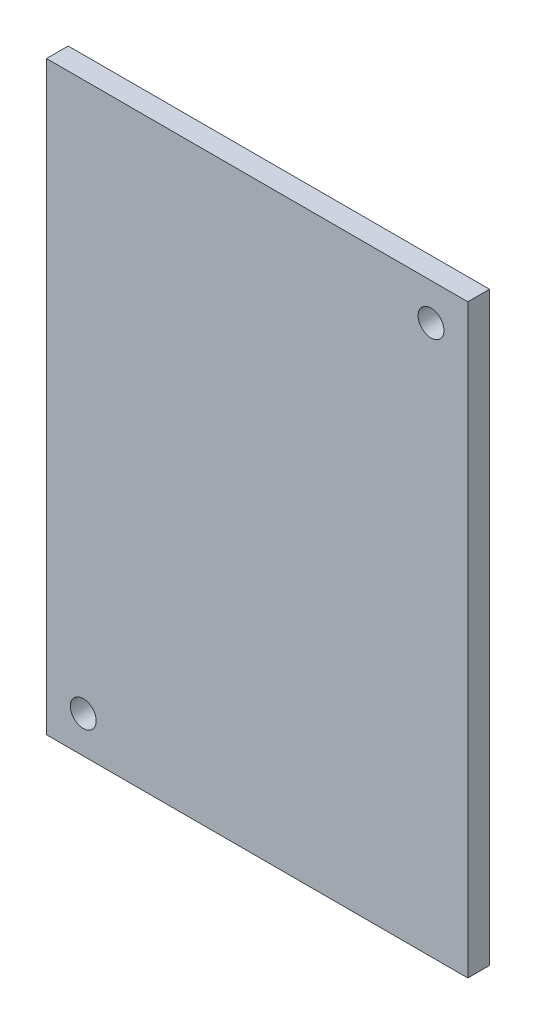
ISO-10303-21;
HEADER;
FILE_DESCRIPTION(('STEP AP214'),'2;1');
FILE_NAME('part.step','',(''),(''),'','','');
FILE_SCHEMA(('AUTOMOTIVE_DESIGN { 1 0 10303 214 1 1 1 1 }'));
ENDSEC;
DATA;
#1=APPLICATION_CONTEXT('core data for automotive mechanical design processes');
#2=APPLICATION_PROTOCOL_DEFINITION('international standard','automotive_design',2000,#1);
#3=PRODUCT_CONTEXT('',#1,'mechanical');
#4=PRODUCT('Part','Part','',(#3));
#5=PRODUCT_RELATED_PRODUCT_CATEGORY('part','',(#4));
#6=PRODUCT_DEFINITION_FORMATION('','',#4);
#7=PRODUCT_DEFINITION_CONTEXT('part definition',#1,'design');
#8=PRODUCT_DEFINITION('design','',#6,#7);
#9=PRODUCT_DEFINITION_SHAPE('','',#8);
#10=(LENGTH_UNIT() NAMED_UNIT(*) SI_UNIT(.MILLI.,.METRE.));
#11=(NAMED_UNIT(*) PLANE_ANGLE_UNIT() SI_UNIT($,.RADIAN.));
#12=(NAMED_UNIT(*) SI_UNIT($,.STERADIAN.) SOLID_ANGLE_UNIT());
#13=UNCERTAINTY_MEASURE_WITH_UNIT(LENGTH_MEASURE(1.E-05),#10,'distance_accuracy_value','');
#14=(GEOMETRIC_REPRESENTATION_CONTEXT(3) GLOBAL_UNCERTAINTY_ASSIGNED_CONTEXT((#13)) GLOBAL_UNIT_ASSIGNED_CONTEXT((#10,
#11,#12)) REPRESENTATION_CONTEXT('',''));
#15=CARTESIAN_POINT('',(0.,0.,0.));
#16=DIRECTION('',(0.,0.,1.));
#17=DIRECTION('',(1.,0.,0.));
#18=AXIS2_PLACEMENT_3D('',#15,#16,#17);
#19=CARTESIAN_POINT('',(29.085,40.43,2.9972));
#20=DIRECTION('',(0.,-1.,0.));
#21=DIRECTION('',(0.,0.,-1.));
#22=AXIS2_PLACEMENT_3D('',#19,#20,#21);
#23=PLANE('',#22);
#24=DIRECTION('',(-1.,0.,0.));
#25=VECTOR('',#24,1.);
#26=CARTESIAN_POINT('',(29.085,40.43,0.));
#27=LINE('',#26,#25);
#28=CARTESIAN_POINT('',(29.085,40.43,0.));
#29=VERTEX_POINT('',#28);
#30=CARTESIAN_POINT('',(-29.085,40.43,0.));
#31=VERTEX_POINT('',#30);
#32=EDGE_CURVE('E104',#29,#31,#27,.T.);
#33=ORIENTED_EDGE('',*,*,#32,.T.);
#34=DIRECTION('',(0.,0.,-1.));
#35=VECTOR('',#34,1.);
#36=CARTESIAN_POINT('',(-29.085,40.43,2.9972));
#37=LINE('',#36,#35);
#38=CARTESIAN_POINT('',(-29.085,40.43,2.9972));
#39=VERTEX_POINT('',#38);
#40=EDGE_CURVE('E11',#39,#31,#37,.T.);
#41=ORIENTED_EDGE('',*,*,#40,.F.);
#42=DIRECTION('',(-1.,0.,0.));
#43=VECTOR('',#42,1.);
#44=CARTESIAN_POINT('',(29.085,40.43,2.9972));
#45=LINE('',#44,#43);
#46=CARTESIAN_POINT('',(29.085,40.43,2.9972));
#47=VERTEX_POINT('',#46);
#48=EDGE_CURVE('E92',#47,#39,#45,.T.);
#49=ORIENTED_EDGE('',*,*,#48,.F.);
#50=DIRECTION('',(0.,0.,-1.));
#51=VECTOR('',#50,1.);
#52=CARTESIAN_POINT('',(29.085,40.43,2.9972));
#53=LINE('',#52,#51);
#54=EDGE_CURVE('E100',#47,#29,#53,.T.);
#55=ORIENTED_EDGE('',*,*,#54,.T.);
#56=EDGE_LOOP('',(#33,#41,#49,#55));
#57=FACE_BOUND('',#56,.T.);
#58=ADVANCED_FACE('F41',(#57),#23,.F.);
#59=CARTESIAN_POINT('',(-29.085,-40.43,2.9972));
#60=DIRECTION('',(1.,0.,0.));
#61=DIRECTION('',(0.,0.,-1.));
#62=AXIS2_PLACEMENT_3D('',#59,#60,#61);
#63=PLANE('',#62);
#64=DIRECTION('',(0.,-1.,0.));
#65=VECTOR('',#64,1.);
#66=CARTESIAN_POINT('',(-29.085,-40.43,0.));
#67=LINE('',#66,#65);
#68=CARTESIAN_POINT('',(-29.085,-40.43,0.));
#69=VERTEX_POINT('',#68);
#70=EDGE_CURVE('E96',#31,#69,#67,.T.);
#71=ORIENTED_EDGE('',*,*,#70,.T.);
#72=DIRECTION('',(0.,0.,-1.));
#73=VECTOR('',#72,1.);
#74=CARTESIAN_POINT('',(-29.085,-40.43,2.9972));
#75=LINE('',#74,#73);
#76=CARTESIAN_POINT('',(-29.085,-40.43,2.9972));
#77=VERTEX_POINT('',#76);
#78=EDGE_CURVE('E49',#77,#69,#75,.T.);
#79=ORIENTED_EDGE('',*,*,#78,.F.);
#80=DIRECTION('',(0.,-1.,0.));
#81=VECTOR('',#80,1.);
#82=CARTESIAN_POINT('',(-29.085,-40.43,2.9972));
#83=LINE('',#82,#81);
#84=EDGE_CURVE('E87',#39,#77,#83,.T.);
#85=ORIENTED_EDGE('',*,*,#84,.F.);
#86=ORIENTED_EDGE('',*,*,#40,.T.);
#87=EDGE_LOOP('',(#71,#79,#85,#86));
#88=FACE_BOUND('',#87,.T.);
#89=ADVANCED_FACE('F95',(#88),#63,.F.);
#90=CARTESIAN_POINT('',(29.085,-40.43,2.9972));
#91=DIRECTION('',(0.,1.,0.));
#92=DIRECTION('',(0.,0.,1.));
#93=AXIS2_PLACEMENT_3D('',#90,#91,#92);
#94=PLANE('',#93);
#95=DIRECTION('',(1.,0.,0.));
#96=VECTOR('',#95,1.);
#97=CARTESIAN_POINT('',(29.085,-40.43,0.));
#98=LINE('',#97,#96);
#99=CARTESIAN_POINT('',(29.085,-40.43,0.));
#100=VERTEX_POINT('',#99);
#101=EDGE_CURVE('E74',#69,#100,#98,.T.);
#102=ORIENTED_EDGE('',*,*,#101,.T.);
#103=DIRECTION('',(0.,0.,-1.));
#104=VECTOR('',#103,1.);
#105=CARTESIAN_POINT('',(29.085,-40.43,2.9972));
#106=LINE('',#105,#104);
#107=CARTESIAN_POINT('',(29.085,-40.43,2.9972));
#108=VERTEX_POINT('',#107);
#109=EDGE_CURVE('E97',#108,#100,#106,.T.);
#110=ORIENTED_EDGE('',*,*,#109,.F.);
#111=DIRECTION('',(1.,0.,0.));
#112=VECTOR('',#111,1.);
#113=CARTESIAN_POINT('',(29.085,-40.43,2.9972));
#114=LINE('',#113,#112);
#115=EDGE_CURVE('E90',#77,#108,#114,.T.);
#116=ORIENTED_EDGE('',*,*,#115,.F.);
#117=ORIENTED_EDGE('',*,*,#78,.T.);
#118=EDGE_LOOP('',(#102,#110,#116,#117));
#119=FACE_BOUND('',#118,.T.);
#120=ADVANCED_FACE('F98',(#119),#94,.F.);
#121=CARTESIAN_POINT('',(29.085,-40.43,2.9972));
#122=DIRECTION('',(-1.,0.,0.));
#123=DIRECTION('',(0.,0.,1.));
#124=AXIS2_PLACEMENT_3D('',#121,#122,#123);
#125=PLANE('',#124);
#126=DIRECTION('',(0.,1.,0.));
#127=VECTOR('',#126,1.);
#128=CARTESIAN_POINT('',(29.085,-40.43,0.));
#129=LINE('',#128,#127);
#130=EDGE_CURVE('E80',#100,#29,#129,.T.);
#131=ORIENTED_EDGE('',*,*,#130,.T.);
#132=ORIENTED_EDGE('',*,*,#54,.F.);
#133=DIRECTION('',(0.,1.,0.));
#134=VECTOR('',#133,1.);
#135=CARTESIAN_POINT('',(29.085,-40.43,2.9972));
#136=LINE('',#135,#134);
#137=EDGE_CURVE('E57',#108,#47,#136,.T.);
#138=ORIENTED_EDGE('',*,*,#137,.F.);
#139=ORIENTED_EDGE('',*,*,#109,.T.);
#140=EDGE_LOOP('',(#131,#132,#138,#139));
#141=FACE_BOUND('',#140,.T.);
#142=ADVANCED_FACE('F112',(#141),#125,.F.);
#143=CARTESIAN_POINT('',(0.,0.,2.9972));
#144=DIRECTION('',(0.,0.,-1.));
#145=DIRECTION('',(-1.,0.,0.));
#146=AXIS2_PLACEMENT_3D('',#143,#144,#145);
#147=PLANE('',#146);
#148=CARTESIAN_POINT('',(24.005,35.35,2.9972));
#149=DIRECTION('',(0.,0.,1.));
#150=DIRECTION('',(1.,0.,0.));
#151=AXIS2_PLACEMENT_3D('',#148,#149,#150);
#152=CIRCLE('',#151,1.786001);
#153=CARTESIAN_POINT('',(25.791001,35.35,2.9972));
#154=VERTEX_POINT('',#153);
#155=EDGE_CURVE('E126',#154,#154,#152,.T.);
#156=ORIENTED_EDGE('',*,*,#155,.F.);
#157=EDGE_LOOP('',(#156));
#158=FACE_BOUND('',#157,.T.);
#159=CARTESIAN_POINT('',(-24.005,-35.35,2.9972));
#160=DIRECTION('',(0.,0.,1.));
#161=DIRECTION('',(1.,0.,0.));
#162=AXIS2_PLACEMENT_3D('',#159,#160,#161);
#163=CIRCLE('',#162,1.786001);
#164=CARTESIAN_POINT('',(-22.218999,-35.35,2.9972));
#165=VERTEX_POINT('',#164);
#166=EDGE_CURVE('E120',#165,#165,#163,.T.);
#167=ORIENTED_EDGE('',*,*,#166,.F.);
#168=EDGE_LOOP('',(#167));
#169=FACE_BOUND('',#168,.T.);
#170=ORIENTED_EDGE('',*,*,#48,.T.);
#171=ORIENTED_EDGE('',*,*,#84,.T.);
#172=ORIENTED_EDGE('',*,*,#115,.T.);
#173=ORIENTED_EDGE('',*,*,#137,.T.);
#174=EDGE_LOOP('',(#170,#171,#172,#173));
#175=FACE_BOUND('',#174,.T.);
#176=ADVANCED_FACE('F88',(#158,#169,#175),#147,.F.);
#177=CARTESIAN_POINT('',(0.,0.,0.));
#178=DIRECTION('',(0.,0.,-1.));
#179=DIRECTION('',(-1.,0.,0.));
#180=AXIS2_PLACEMENT_3D('',#177,#178,#179);
#181=PLANE('',#180);
#182=CARTESIAN_POINT('',(24.005,35.35,0.));
#183=DIRECTION('',(0.,0.,1.));
#184=DIRECTION('',(1.,0.,0.));
#185=AXIS2_PLACEMENT_3D('',#182,#183,#184);
#186=CIRCLE('',#185,1.786001);
#187=CARTESIAN_POINT('',(25.791001,35.35,0.));
#188=VERTEX_POINT('',#187);
#189=EDGE_CURVE('E123',#188,#188,#186,.T.);
#190=ORIENTED_EDGE('',*,*,#189,.T.);
#191=EDGE_LOOP('',(#190));
#192=FACE_BOUND('',#191,.T.);
#193=CARTESIAN_POINT('',(-24.005,-35.35,0.));
#194=DIRECTION('',(0.,0.,1.));
#195=DIRECTION('',(1.,0.,0.));
#196=AXIS2_PLACEMENT_3D('',#193,#194,#195);
#197=CIRCLE('',#196,1.786001);
#198=CARTESIAN_POINT('',(-22.218999,-35.35,0.));
#199=VERTEX_POINT('',#198);
#200=EDGE_CURVE('E107',#199,#199,#197,.T.);
#201=ORIENTED_EDGE('',*,*,#200,.T.);
#202=EDGE_LOOP('',(#201));
#203=FACE_BOUND('',#202,.T.);
#204=ORIENTED_EDGE('',*,*,#32,.F.);
#205=ORIENTED_EDGE('',*,*,#130,.F.);
#206=ORIENTED_EDGE('',*,*,#101,.F.);
#207=ORIENTED_EDGE('',*,*,#70,.F.);
#208=EDGE_LOOP('',(#204,#205,#206,#207));
#209=FACE_BOUND('',#208,.T.);
#210=ADVANCED_FACE('F115',(#192,#203,#209),#181,.T.);
#211=CARTESIAN_POINT('',(-24.005,-35.35,2.9972));
#212=DIRECTION('',(0.,0.,1.));
#213=DIRECTION('',(1.,0.,0.));
#214=AXIS2_PLACEMENT_3D('',#211,#212,#213);
#215=CYLINDRICAL_SURFACE('',#214,1.786001);
#216=ORIENTED_EDGE('',*,*,#200,.F.);
#217=EDGE_LOOP('',(#216));
#218=FACE_BOUND('',#217,.T.);
#219=ORIENTED_EDGE('',*,*,#166,.T.);
#220=EDGE_LOOP('',(#219));
#221=FACE_BOUND('',#220,.T.);
#222=ADVANCED_FACE('F137',(#218,#221),#215,.F.);
#223=CARTESIAN_POINT('',(24.005,35.35,2.9972));
#224=DIRECTION('',(0.,0.,1.));
#225=DIRECTION('',(1.,0.,0.));
#226=AXIS2_PLACEMENT_3D('',#223,#224,#225);
#227=CYLINDRICAL_SURFACE('',#226,1.786001);
#228=ORIENTED_EDGE('',*,*,#189,.F.);
#229=EDGE_LOOP('',(#228));
#230=FACE_BOUND('',#229,.T.);
#231=ORIENTED_EDGE('',*,*,#155,.T.);
#232=EDGE_LOOP('',(#231));
#233=FACE_BOUND('',#232,.T.);
#234=ADVANCED_FACE('F130',(#230,#233),#227,.F.);
#235=CLOSED_SHELL('',(#58,#89,#120,#142,#176,#210,#222,#234));
#236=MANIFOLD_SOLID_BREP('B2',#235);
#237=ADVANCED_BREP_SHAPE_REPRESENTATION('',(#18,#236),#14);
#238=SHAPE_DEFINITION_REPRESENTATION(#9,#237);
ENDSEC;
END-ISO-10303-21;
